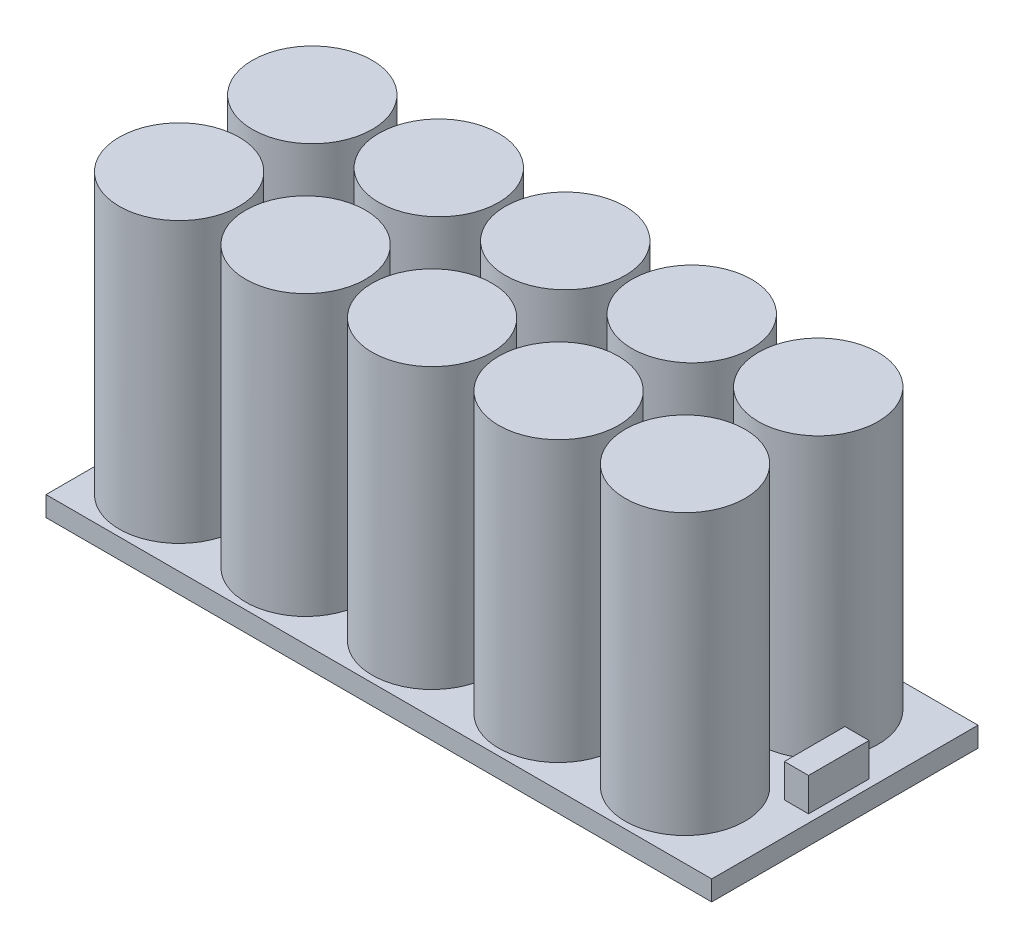
ISO-10303-21;
HEADER;
FILE_DESCRIPTION(('STEP AP214'),'2;1');
FILE_NAME('part.step','',(''),(''),'','','');
FILE_SCHEMA(('AUTOMOTIVE_DESIGN { 1 0 10303 214 1 1 1 1 }'));
ENDSEC;
DATA;
#1=APPLICATION_CONTEXT('core data for automotive mechanical design processes');
#2=APPLICATION_PROTOCOL_DEFINITION('international standard','automotive_design',2000,#1);
#3=PRODUCT_CONTEXT('',#1,'mechanical');
#4=PRODUCT('Part','Part','',(#3));
#5=PRODUCT_RELATED_PRODUCT_CATEGORY('part','',(#4));
#6=PRODUCT_DEFINITION_FORMATION('','',#4);
#7=PRODUCT_DEFINITION_CONTEXT('part definition',#1,'design');
#8=PRODUCT_DEFINITION('design','',#6,#7);
#9=PRODUCT_DEFINITION_SHAPE('','',#8);
#10=(LENGTH_UNIT() NAMED_UNIT(*) SI_UNIT(.MILLI.,.METRE.));
#11=(NAMED_UNIT(*) PLANE_ANGLE_UNIT() SI_UNIT($,.RADIAN.));
#12=(NAMED_UNIT(*) SI_UNIT($,.STERADIAN.) SOLID_ANGLE_UNIT());
#13=UNCERTAINTY_MEASURE_WITH_UNIT(LENGTH_MEASURE(1.E-05),#10,'distance_accuracy_value','');
#14=(GEOMETRIC_REPRESENTATION_CONTEXT(3) GLOBAL_UNCERTAINTY_ASSIGNED_CONTEXT((#13)) GLOBAL_UNIT_ASSIGNED_CONTEXT((#10,
#11,#12)) REPRESENTATION_CONTEXT('',''));
#15=CARTESIAN_POINT('',(0.,0.,0.));
#16=DIRECTION('',(0.,0.,1.));
#17=DIRECTION('',(1.,0.,0.));
#18=AXIS2_PLACEMENT_3D('',#15,#16,#17);
#19=CARTESIAN_POINT('',(0.,3.,0.));
#20=DIRECTION('',(0.,-1.,0.));
#21=DIRECTION('',(0.,0.,-1.));
#22=AXIS2_PLACEMENT_3D('',#19,#20,#21);
#23=PLANE('',#22);
#24=DIRECTION('',(0.,0.,-1.));
#25=VECTOR('',#24,1.);
#26=CARTESIAN_POINT('',(50.,3.,20.));
#27=LINE('',#26,#25);
#28=CARTESIAN_POINT('',(50.,3.,20.));
#29=VERTEX_POINT('',#28);
#30=CARTESIAN_POINT('',(50.,3.,-20.));
#31=VERTEX_POINT('',#30);
#32=EDGE_CURVE('E156',#29,#31,#27,.T.);
#33=ORIENTED_EDGE('',*,*,#32,.T.);
#34=DIRECTION('',(-1.,0.,0.));
#35=VECTOR('',#34,1.);
#36=CARTESIAN_POINT('',(-50.,3.,-20.));
#37=LINE('',#36,#35);
#38=CARTESIAN_POINT('',(-50.,3.,-20.));
#39=VERTEX_POINT('',#38);
#40=EDGE_CURVE('E159',#31,#39,#37,.T.);
#41=ORIENTED_EDGE('',*,*,#40,.T.);
#42=DIRECTION('',(0.,0.,1.));
#43=VECTOR('',#42,1.);
#44=CARTESIAN_POINT('',(-50.,3.,20.));
#45=LINE('',#44,#43);
#46=CARTESIAN_POINT('',(-50.,3.,20.));
#47=VERTEX_POINT('',#46);
#48=EDGE_CURVE('E162',#39,#47,#45,.T.);
#49=ORIENTED_EDGE('',*,*,#48,.T.);
#50=DIRECTION('',(1.,0.,0.));
#51=VECTOR('',#50,1.);
#52=CARTESIAN_POINT('',(-50.,3.,20.));
#53=LINE('',#52,#51);
#54=EDGE_CURVE('E164',#47,#29,#53,.T.);
#55=ORIENTED_EDGE('',*,*,#54,.T.);
#56=EDGE_LOOP('',(#33,#41,#49,#55));
#57=FACE_BOUND('',#56,.T.);
#58=CARTESIAN_POINT('',(-40.,3.,9.99999999999999));
#59=DIRECTION('',(0.,-1.,0.));
#60=DIRECTION('',(0.,0.,-1.));
#61=AXIS2_PLACEMENT_3D('',#58,#59,#60);
#62=CIRCLE('',#61,9.);
#63=CARTESIAN_POINT('',(-40.,3.,0.999999999999999));
#64=VERTEX_POINT('',#63);
#65=EDGE_CURVE('E185',#64,#64,#62,.F.);
#66=ORIENTED_EDGE('',*,*,#65,.F.);
#67=EDGE_LOOP('',(#66));
#68=FACE_BOUND('',#67,.T.);
#69=CARTESIAN_POINT('',(-21.,3.,9.99999999999999));
#70=DIRECTION('',(0.,-1.,0.));
#71=DIRECTION('',(0.,0.,-1.));
#72=AXIS2_PLACEMENT_3D('',#69,#70,#71);
#73=CIRCLE('',#72,9.);
#74=CARTESIAN_POINT('',(-21.,3.,0.999999999999999));
#75=VERTEX_POINT('',#74);
#76=EDGE_CURVE('E188',#75,#75,#73,.F.);
#77=ORIENTED_EDGE('',*,*,#76,.F.);
#78=EDGE_LOOP('',(#77));
#79=FACE_BOUND('',#78,.T.);
#80=CARTESIAN_POINT('',(-2.,3.,9.99999999999999));
#81=DIRECTION('',(0.,-1.,0.));
#82=DIRECTION('',(0.,0.,-1.));
#83=AXIS2_PLACEMENT_3D('',#80,#81,#82);
#84=CIRCLE('',#83,9.);
#85=CARTESIAN_POINT('',(-2.,3.,0.999999999999999));
#86=VERTEX_POINT('',#85);
#87=EDGE_CURVE('E191',#86,#86,#84,.F.);
#88=ORIENTED_EDGE('',*,*,#87,.F.);
#89=EDGE_LOOP('',(#88));
#90=FACE_BOUND('',#89,.T.);
#91=CARTESIAN_POINT('',(17.,3.,9.99999999999999));
#92=DIRECTION('',(0.,-1.,0.));
#93=DIRECTION('',(0.,0.,-1.));
#94=AXIS2_PLACEMENT_3D('',#91,#92,#93);
#95=CIRCLE('',#94,9.);
#96=CARTESIAN_POINT('',(17.,3.,0.999999999999999));
#97=VERTEX_POINT('',#96);
#98=EDGE_CURVE('E194',#97,#97,#95,.F.);
#99=ORIENTED_EDGE('',*,*,#98,.F.);
#100=EDGE_LOOP('',(#99));
#101=FACE_BOUND('',#100,.T.);
#102=CARTESIAN_POINT('',(36.,3.,9.99999999999999));
#103=DIRECTION('',(0.,-1.,0.));
#104=DIRECTION('',(0.,0.,-1.));
#105=AXIS2_PLACEMENT_3D('',#102,#103,#104);
#106=CIRCLE('',#105,9.);
#107=CARTESIAN_POINT('',(36.,3.,0.999999999999999));
#108=VERTEX_POINT('',#107);
#109=EDGE_CURVE('E197',#108,#108,#106,.F.);
#110=ORIENTED_EDGE('',*,*,#109,.F.);
#111=EDGE_LOOP('',(#110));
#112=FACE_BOUND('',#111,.T.);
#113=CARTESIAN_POINT('',(-21.0000000000001,3.,-10.));
#114=DIRECTION('',(0.,-1.,0.));
#115=DIRECTION('',(0.,0.,-1.));
#116=AXIS2_PLACEMENT_3D('',#113,#114,#115);
#117=CIRCLE('',#116,9.);
#118=CARTESIAN_POINT('',(-21.0000000000001,3.,-19.));
#119=VERTEX_POINT('',#118);
#120=EDGE_CURVE('E200',#119,#119,#117,.F.);
#121=ORIENTED_EDGE('',*,*,#120,.F.);
#122=EDGE_LOOP('',(#121));
#123=FACE_BOUND('',#122,.T.);
#124=CARTESIAN_POINT('',(-2.00000000000007,3.,-10.));
#125=DIRECTION('',(0.,-1.,0.));
#126=DIRECTION('',(0.,0.,-1.));
#127=AXIS2_PLACEMENT_3D('',#124,#125,#126);
#128=CIRCLE('',#127,9.);
#129=CARTESIAN_POINT('',(-2.00000000000007,3.,-19.));
#130=VERTEX_POINT('',#129);
#131=EDGE_CURVE('E203',#130,#130,#128,.F.);
#132=ORIENTED_EDGE('',*,*,#131,.F.);
#133=EDGE_LOOP('',(#132));
#134=FACE_BOUND('',#133,.T.);
#135=CARTESIAN_POINT('',(16.9999999999999,3.,-10.));
#136=DIRECTION('',(0.,-1.,0.));
#137=DIRECTION('',(0.,0.,-1.));
#138=AXIS2_PLACEMENT_3D('',#135,#136,#137);
#139=CIRCLE('',#138,9.);
#140=CARTESIAN_POINT('',(16.9999999999999,3.,-19.));
#141=VERTEX_POINT('',#140);
#142=EDGE_CURVE('E206',#141,#141,#139,.F.);
#143=ORIENTED_EDGE('',*,*,#142,.F.);
#144=EDGE_LOOP('',(#143));
#145=FACE_BOUND('',#144,.T.);
#146=CARTESIAN_POINT('',(35.9999999999999,3.,-10.));
#147=DIRECTION('',(0.,-1.,0.));
#148=DIRECTION('',(0.,0.,-1.));
#149=AXIS2_PLACEMENT_3D('',#146,#147,#148);
#150=CIRCLE('',#149,9.);
#151=CARTESIAN_POINT('',(35.9999999999999,3.,-19.));
#152=VERTEX_POINT('',#151);
#153=EDGE_CURVE('E42',#152,#152,#150,.F.);
#154=ORIENTED_EDGE('',*,*,#153,.F.);
#155=EDGE_LOOP('',(#154));
#156=FACE_BOUND('',#155,.T.);
#157=CARTESIAN_POINT('',(-40.0000000000001,3.,-10.));
#158=DIRECTION('',(0.,-1.,0.));
#159=DIRECTION('',(0.,0.,-1.));
#160=AXIS2_PLACEMENT_3D('',#157,#158,#159);
#161=CIRCLE('',#160,9.);
#162=CARTESIAN_POINT('',(-40.0000000000001,3.,-19.));
#163=VERTEX_POINT('',#162);
#164=EDGE_CURVE('E11',#163,#163,#161,.F.);
#165=ORIENTED_EDGE('',*,*,#164,.F.);
#166=EDGE_LOOP('',(#165));
#167=FACE_BOUND('',#166,.T.);
#168=DIRECTION('',(0.,0.,1.));
#169=VECTOR('',#168,1.);
#170=CARTESIAN_POINT('',(45.1816821701155,3.,-4.82622217345269));
#171=LINE('',#170,#169);
#172=CARTESIAN_POINT('',(45.1816821701155,3.,-4.82622217345269));
#173=VERTEX_POINT('',#172);
#174=CARTESIAN_POINT('',(45.1816821701155,3.,4.26543491181469));
#175=VERTEX_POINT('',#174);
#176=EDGE_CURVE('E119',#173,#175,#171,.T.);
#177=ORIENTED_EDGE('',*,*,#176,.F.);
#178=DIRECTION('',(-1.,0.,0.));
#179=VECTOR('',#178,1.);
#180=CARTESIAN_POINT('',(45.1816821701155,3.,-4.82622217345269));
#181=LINE('',#180,#179);
#182=CARTESIAN_POINT('',(48.8112972080323,3.,-4.82622217345269));
#183=VERTEX_POINT('',#182);
#184=EDGE_CURVE('E116',#183,#173,#181,.T.);
#185=ORIENTED_EDGE('',*,*,#184,.F.);
#186=DIRECTION('',(0.,0.,-1.));
#187=VECTOR('',#186,1.);
#188=CARTESIAN_POINT('',(48.8112972080323,3.,-4.82622217345269));
#189=LINE('',#188,#187);
#190=CARTESIAN_POINT('',(48.8112972080323,3.,4.26543491181469));
#191=VERTEX_POINT('',#190);
#192=EDGE_CURVE('E54',#191,#183,#189,.T.);
#193=ORIENTED_EDGE('',*,*,#192,.F.);
#194=DIRECTION('',(1.,0.,0.));
#195=VECTOR('',#194,1.);
#196=CARTESIAN_POINT('',(45.1816821701155,3.,4.26543491181469));
#197=LINE('',#196,#195);
#198=EDGE_CURVE('E49',#175,#191,#197,.T.);
#199=ORIENTED_EDGE('',*,*,#198,.F.);
#200=EDGE_LOOP('',(#177,#185,#193,#199));
#201=FACE_BOUND('',#200,.T.);
#202=ADVANCED_FACE('F34',(#57,#68,#79,#90,#101,#112,#123,#134,#145,#156,#167,#201),#23,.F.);
#203=CARTESIAN_POINT('',(50.,3.,20.));
#204=DIRECTION('',(-1.,0.,0.));
#205=DIRECTION('',(0.,0.,1.));
#206=AXIS2_PLACEMENT_3D('',#203,#204,#205);
#207=PLANE('',#206);
#208=DIRECTION('',(0.,0.,-1.));
#209=VECTOR('',#208,1.);
#210=CARTESIAN_POINT('',(50.,0.,20.));
#211=LINE('',#210,#209);
#212=CARTESIAN_POINT('',(50.,0.,20.));
#213=VERTEX_POINT('',#212);
#214=CARTESIAN_POINT('',(50.,0.,-20.));
#215=VERTEX_POINT('',#214);
#216=EDGE_CURVE('E155',#213,#215,#211,.T.);
#217=ORIENTED_EDGE('',*,*,#216,.T.);
#218=DIRECTION('',(0.,-1.,0.));
#219=VECTOR('',#218,1.);
#220=CARTESIAN_POINT('',(50.,3.,-20.));
#221=LINE('',#220,#219);
#222=EDGE_CURVE('E182',#31,#215,#221,.T.);
#223=ORIENTED_EDGE('',*,*,#222,.F.);
#224=ORIENTED_EDGE('',*,*,#32,.F.);
#225=DIRECTION('',(0.,-1.,0.));
#226=VECTOR('',#225,1.);
#227=CARTESIAN_POINT('',(50.,3.,20.));
#228=LINE('',#227,#226);
#229=EDGE_CURVE('E166',#29,#213,#228,.T.);
#230=ORIENTED_EDGE('',*,*,#229,.T.);
#231=EDGE_LOOP('',(#217,#223,#224,#230));
#232=FACE_BOUND('',#231,.T.);
#233=ADVANCED_FACE('F36',(#232),#207,.F.);
#234=CARTESIAN_POINT('',(-50.,3.,-20.));
#235=DIRECTION('',(0.,0.,1.));
#236=DIRECTION('',(1.,0.,0.));
#237=AXIS2_PLACEMENT_3D('',#234,#235,#236);
#238=PLANE('',#237);
#239=DIRECTION('',(-1.,0.,0.));
#240=VECTOR('',#239,1.);
#241=CARTESIAN_POINT('',(-50.,0.,-20.));
#242=LINE('',#241,#240);
#243=CARTESIAN_POINT('',(-50.,0.,-20.));
#244=VERTEX_POINT('',#243);
#245=EDGE_CURVE('E169',#215,#244,#242,.T.);
#246=ORIENTED_EDGE('',*,*,#245,.T.);
#247=DIRECTION('',(0.,-1.,0.));
#248=VECTOR('',#247,1.);
#249=CARTESIAN_POINT('',(-50.,3.,-20.));
#250=LINE('',#249,#248);
#251=EDGE_CURVE('E179',#39,#244,#250,.T.);
#252=ORIENTED_EDGE('',*,*,#251,.F.);
#253=ORIENTED_EDGE('',*,*,#40,.F.);
#254=ORIENTED_EDGE('',*,*,#222,.T.);
#255=EDGE_LOOP('',(#246,#252,#253,#254));
#256=FACE_BOUND('',#255,.T.);
#257=ADVANCED_FACE('F334',(#256),#238,.F.);
#258=CARTESIAN_POINT('',(-50.,3.,20.));
#259=DIRECTION('',(1.,0.,0.));
#260=DIRECTION('',(0.,0.,-1.));
#261=AXIS2_PLACEMENT_3D('',#258,#259,#260);
#262=PLANE('',#261);
#263=DIRECTION('',(0.,0.,1.));
#264=VECTOR('',#263,1.);
#265=CARTESIAN_POINT('',(-50.,0.,20.));
#266=LINE('',#265,#264);
#267=CARTESIAN_POINT('',(-50.,0.,20.));
#268=VERTEX_POINT('',#267);
#269=EDGE_CURVE('E171',#244,#268,#266,.T.);
#270=ORIENTED_EDGE('',*,*,#269,.T.);
#271=DIRECTION('',(0.,-1.,0.));
#272=VECTOR('',#271,1.);
#273=CARTESIAN_POINT('',(-50.,3.,20.));
#274=LINE('',#273,#272);
#275=EDGE_CURVE('E176',#47,#268,#274,.T.);
#276=ORIENTED_EDGE('',*,*,#275,.F.);
#277=ORIENTED_EDGE('',*,*,#48,.F.);
#278=ORIENTED_EDGE('',*,*,#251,.T.);
#279=EDGE_LOOP('',(#270,#276,#277,#278));
#280=FACE_BOUND('',#279,.T.);
#281=ADVANCED_FACE('F331',(#280),#262,.F.);
#282=CARTESIAN_POINT('',(-50.,3.,20.));
#283=DIRECTION('',(0.,0.,-1.));
#284=DIRECTION('',(-1.,0.,0.));
#285=AXIS2_PLACEMENT_3D('',#282,#283,#284);
#286=PLANE('',#285);
#287=DIRECTION('',(1.,0.,0.));
#288=VECTOR('',#287,1.);
#289=CARTESIAN_POINT('',(-50.,0.,20.));
#290=LINE('',#289,#288);
#291=EDGE_CURVE('E160',#268,#213,#290,.T.);
#292=ORIENTED_EDGE('',*,*,#291,.T.);
#293=ORIENTED_EDGE('',*,*,#229,.F.);
#294=ORIENTED_EDGE('',*,*,#54,.F.);
#295=ORIENTED_EDGE('',*,*,#275,.T.);
#296=EDGE_LOOP('',(#292,#293,#294,#295));
#297=FACE_BOUND('',#296,.T.);
#298=ADVANCED_FACE('F327',(#297),#286,.F.);
#299=CARTESIAN_POINT('',(0.,0.,0.));
#300=DIRECTION('',(0.,-1.,0.));
#301=DIRECTION('',(0.,0.,-1.));
#302=AXIS2_PLACEMENT_3D('',#299,#300,#301);
#303=PLANE('',#302);
#304=ORIENTED_EDGE('',*,*,#216,.F.);
#305=ORIENTED_EDGE('',*,*,#291,.F.);
#306=ORIENTED_EDGE('',*,*,#269,.F.);
#307=ORIENTED_EDGE('',*,*,#245,.F.);
#308=EDGE_LOOP('',(#304,#305,#306,#307));
#309=FACE_BOUND('',#308,.T.);
#310=ADVANCED_FACE('F322',(#309),#303,.T.);
#311=CARTESIAN_POINT('',(-40.,45.,9.99999999999999));
#312=DIRECTION('',(0.,-1.,0.));
#313=DIRECTION('',(0.,0.,-1.));
#314=AXIS2_PLACEMENT_3D('',#311,#312,#313);
#315=CYLINDRICAL_SURFACE('',#314,9.);
#316=CARTESIAN_POINT('',(-40.,45.,9.99999999999999));
#317=DIRECTION('',(0.,1.,0.));
#318=DIRECTION('',(0.,0.,1.));
#319=AXIS2_PLACEMENT_3D('',#316,#317,#318);
#320=CIRCLE('',#319,9.);
#321=CARTESIAN_POINT('',(-40.,45.,19.));
#322=VERTEX_POINT('',#321);
#323=EDGE_CURVE('E152',#322,#322,#320,.T.);
#324=ORIENTED_EDGE('',*,*,#323,.F.);
#325=EDGE_LOOP('',(#324));
#326=FACE_BOUND('',#325,.T.);
#327=ORIENTED_EDGE('',*,*,#65,.T.);
#328=EDGE_LOOP('',(#327));
#329=FACE_BOUND('',#328,.T.);
#330=ADVANCED_FACE('F319',(#326,#329),#315,.T.);
#331=CARTESIAN_POINT('',(-40.,45.,9.99999999999999));
#332=DIRECTION('',(0.,1.,0.));
#333=DIRECTION('',(0.,0.,1.));
#334=AXIS2_PLACEMENT_3D('',#331,#332,#333);
#335=PLANE('',#334);
#336=ORIENTED_EDGE('',*,*,#323,.T.);
#337=EDGE_LOOP('',(#336));
#338=FACE_BOUND('',#337,.T.);
#339=ADVANCED_FACE('F315',(#338),#335,.T.);
#340=CARTESIAN_POINT('',(-21.,45.,9.99999999999999));
#341=DIRECTION('',(0.,-1.,0.));
#342=DIRECTION('',(0.,0.,-1.));
#343=AXIS2_PLACEMENT_3D('',#340,#341,#342);
#344=CYLINDRICAL_SURFACE('',#343,9.);
#345=CARTESIAN_POINT('',(-21.,45.,9.99999999999999));
#346=DIRECTION('',(0.,1.,0.));
#347=DIRECTION('',(0.,0.,1.));
#348=AXIS2_PLACEMENT_3D('',#345,#346,#347);
#349=CIRCLE('',#348,9.);
#350=CARTESIAN_POINT('',(-21.,45.,19.));
#351=VERTEX_POINT('',#350);
#352=EDGE_CURVE('E149',#351,#351,#349,.T.);
#353=ORIENTED_EDGE('',*,*,#352,.F.);
#354=EDGE_LOOP('',(#353));
#355=FACE_BOUND('',#354,.T.);
#356=ORIENTED_EDGE('',*,*,#76,.T.);
#357=EDGE_LOOP('',(#356));
#358=FACE_BOUND('',#357,.T.);
#359=ADVANCED_FACE('F311',(#355,#358),#344,.T.);
#360=CARTESIAN_POINT('',(-21.,45.,9.99999999999999));
#361=DIRECTION('',(0.,1.,0.));
#362=DIRECTION('',(0.,0.,1.));
#363=AXIS2_PLACEMENT_3D('',#360,#361,#362);
#364=PLANE('',#363);
#365=ORIENTED_EDGE('',*,*,#352,.T.);
#366=EDGE_LOOP('',(#365));
#367=FACE_BOUND('',#366,.T.);
#368=ADVANCED_FACE('F307',(#367),#364,.T.);
#369=CARTESIAN_POINT('',(-2.,45.,9.99999999999999));
#370=DIRECTION('',(0.,-1.,0.));
#371=DIRECTION('',(0.,0.,-1.));
#372=AXIS2_PLACEMENT_3D('',#369,#370,#371);
#373=CYLINDRICAL_SURFACE('',#372,9.);
#374=CARTESIAN_POINT('',(-2.,45.,9.99999999999999));
#375=DIRECTION('',(0.,1.,0.));
#376=DIRECTION('',(0.,0.,1.));
#377=AXIS2_PLACEMENT_3D('',#374,#375,#376);
#378=CIRCLE('',#377,9.);
#379=CARTESIAN_POINT('',(-2.,45.,19.));
#380=VERTEX_POINT('',#379);
#381=EDGE_CURVE('E146',#380,#380,#378,.T.);
#382=ORIENTED_EDGE('',*,*,#381,.F.);
#383=EDGE_LOOP('',(#382));
#384=FACE_BOUND('',#383,.T.);
#385=ORIENTED_EDGE('',*,*,#87,.T.);
#386=EDGE_LOOP('',(#385));
#387=FACE_BOUND('',#386,.T.);
#388=ADVANCED_FACE('F303',(#384,#387),#373,.T.);
#389=CARTESIAN_POINT('',(-2.,45.,9.99999999999999));
#390=DIRECTION('',(0.,1.,0.));
#391=DIRECTION('',(0.,0.,1.));
#392=AXIS2_PLACEMENT_3D('',#389,#390,#391);
#393=PLANE('',#392);
#394=ORIENTED_EDGE('',*,*,#381,.T.);
#395=EDGE_LOOP('',(#394));
#396=FACE_BOUND('',#395,.T.);
#397=ADVANCED_FACE('F299',(#396),#393,.T.);
#398=CARTESIAN_POINT('',(17.,45.,9.99999999999999));
#399=DIRECTION('',(0.,-1.,0.));
#400=DIRECTION('',(0.,0.,-1.));
#401=AXIS2_PLACEMENT_3D('',#398,#399,#400);
#402=CYLINDRICAL_SURFACE('',#401,9.);
#403=CARTESIAN_POINT('',(17.,45.,9.99999999999999));
#404=DIRECTION('',(0.,1.,0.));
#405=DIRECTION('',(0.,0.,1.));
#406=AXIS2_PLACEMENT_3D('',#403,#404,#405);
#407=CIRCLE('',#406,9.);
#408=CARTESIAN_POINT('',(17.,45.,19.));
#409=VERTEX_POINT('',#408);
#410=EDGE_CURVE('E143',#409,#409,#407,.T.);
#411=ORIENTED_EDGE('',*,*,#410,.F.);
#412=EDGE_LOOP('',(#411));
#413=FACE_BOUND('',#412,.T.);
#414=ORIENTED_EDGE('',*,*,#98,.T.);
#415=EDGE_LOOP('',(#414));
#416=FACE_BOUND('',#415,.T.);
#417=ADVANCED_FACE('F295',(#413,#416),#402,.T.);
#418=CARTESIAN_POINT('',(17.,45.,9.99999999999999));
#419=DIRECTION('',(0.,1.,0.));
#420=DIRECTION('',(0.,0.,1.));
#421=AXIS2_PLACEMENT_3D('',#418,#419,#420);
#422=PLANE('',#421);
#423=ORIENTED_EDGE('',*,*,#410,.T.);
#424=EDGE_LOOP('',(#423));
#425=FACE_BOUND('',#424,.T.);
#426=ADVANCED_FACE('F291',(#425),#422,.T.);
#427=CARTESIAN_POINT('',(36.,45.,9.99999999999999));
#428=DIRECTION('',(0.,-1.,0.));
#429=DIRECTION('',(0.,0.,-1.));
#430=AXIS2_PLACEMENT_3D('',#427,#428,#429);
#431=CYLINDRICAL_SURFACE('',#430,9.);
#432=CARTESIAN_POINT('',(36.,45.,9.99999999999999));
#433=DIRECTION('',(0.,1.,0.));
#434=DIRECTION('',(0.,0.,1.));
#435=AXIS2_PLACEMENT_3D('',#432,#433,#434);
#436=CIRCLE('',#435,9.);
#437=CARTESIAN_POINT('',(36.,45.,19.));
#438=VERTEX_POINT('',#437);
#439=EDGE_CURVE('E140',#438,#438,#436,.T.);
#440=ORIENTED_EDGE('',*,*,#439,.F.);
#441=EDGE_LOOP('',(#440));
#442=FACE_BOUND('',#441,.T.);
#443=ORIENTED_EDGE('',*,*,#109,.T.);
#444=EDGE_LOOP('',(#443));
#445=FACE_BOUND('',#444,.T.);
#446=ADVANCED_FACE('F287',(#442,#445),#431,.T.);
#447=CARTESIAN_POINT('',(36.,45.,9.99999999999999));
#448=DIRECTION('',(0.,1.,0.));
#449=DIRECTION('',(0.,0.,1.));
#450=AXIS2_PLACEMENT_3D('',#447,#448,#449);
#451=PLANE('',#450);
#452=ORIENTED_EDGE('',*,*,#439,.T.);
#453=EDGE_LOOP('',(#452));
#454=FACE_BOUND('',#453,.T.);
#455=ADVANCED_FACE('F283',(#454),#451,.T.);
#456=CARTESIAN_POINT('',(-21.0000000000001,45.,-10.));
#457=DIRECTION('',(0.,-1.,0.));
#458=DIRECTION('',(0.,0.,-1.));
#459=AXIS2_PLACEMENT_3D('',#456,#457,#458);
#460=CYLINDRICAL_SURFACE('',#459,9.);
#461=CARTESIAN_POINT('',(-21.0000000000001,45.,-10.));
#462=DIRECTION('',(0.,1.,0.));
#463=DIRECTION('',(0.,0.,1.));
#464=AXIS2_PLACEMENT_3D('',#461,#462,#463);
#465=CIRCLE('',#464,9.);
#466=CARTESIAN_POINT('',(-21.0000000000001,45.,-1.00000000000001));
#467=VERTEX_POINT('',#466);
#468=EDGE_CURVE('E137',#467,#467,#465,.T.);
#469=ORIENTED_EDGE('',*,*,#468,.F.);
#470=EDGE_LOOP('',(#469));
#471=FACE_BOUND('',#470,.T.);
#472=ORIENTED_EDGE('',*,*,#120,.T.);
#473=EDGE_LOOP('',(#472));
#474=FACE_BOUND('',#473,.T.);
#475=ADVANCED_FACE('F279',(#471,#474),#460,.T.);
#476=CARTESIAN_POINT('',(-21.0000000000001,45.,-10.));
#477=DIRECTION('',(0.,1.,0.));
#478=DIRECTION('',(0.,0.,1.));
#479=AXIS2_PLACEMENT_3D('',#476,#477,#478);
#480=PLANE('',#479);
#481=ORIENTED_EDGE('',*,*,#468,.T.);
#482=EDGE_LOOP('',(#481));
#483=FACE_BOUND('',#482,.T.);
#484=ADVANCED_FACE('F275',(#483),#480,.T.);
#485=CARTESIAN_POINT('',(-2.00000000000007,45.,-10.));
#486=DIRECTION('',(0.,-1.,0.));
#487=DIRECTION('',(0.,0.,-1.));
#488=AXIS2_PLACEMENT_3D('',#485,#486,#487);
#489=CYLINDRICAL_SURFACE('',#488,9.);
#490=CARTESIAN_POINT('',(-2.00000000000007,45.,-10.));
#491=DIRECTION('',(0.,1.,0.));
#492=DIRECTION('',(0.,0.,1.));
#493=AXIS2_PLACEMENT_3D('',#490,#491,#492);
#494=CIRCLE('',#493,9.);
#495=CARTESIAN_POINT('',(-2.00000000000007,45.,-1.00000000000001));
#496=VERTEX_POINT('',#495);
#497=EDGE_CURVE('E134',#496,#496,#494,.T.);
#498=ORIENTED_EDGE('',*,*,#497,.F.);
#499=EDGE_LOOP('',(#498));
#500=FACE_BOUND('',#499,.T.);
#501=ORIENTED_EDGE('',*,*,#131,.T.);
#502=EDGE_LOOP('',(#501));
#503=FACE_BOUND('',#502,.T.);
#504=ADVANCED_FACE('F271',(#500,#503),#489,.T.);
#505=CARTESIAN_POINT('',(-2.00000000000007,45.,-10.));
#506=DIRECTION('',(0.,1.,0.));
#507=DIRECTION('',(0.,0.,1.));
#508=AXIS2_PLACEMENT_3D('',#505,#506,#507);
#509=PLANE('',#508);
#510=ORIENTED_EDGE('',*,*,#497,.T.);
#511=EDGE_LOOP('',(#510));
#512=FACE_BOUND('',#511,.T.);
#513=ADVANCED_FACE('F267',(#512),#509,.T.);
#514=CARTESIAN_POINT('',(16.9999999999999,45.,-10.));
#515=DIRECTION('',(0.,-1.,0.));
#516=DIRECTION('',(0.,0.,-1.));
#517=AXIS2_PLACEMENT_3D('',#514,#515,#516);
#518=CYLINDRICAL_SURFACE('',#517,9.);
#519=CARTESIAN_POINT('',(16.9999999999999,45.,-10.));
#520=DIRECTION('',(0.,1.,0.));
#521=DIRECTION('',(0.,0.,1.));
#522=AXIS2_PLACEMENT_3D('',#519,#520,#521);
#523=CIRCLE('',#522,9.);
#524=CARTESIAN_POINT('',(16.9999999999999,45.,-1.00000000000001));
#525=VERTEX_POINT('',#524);
#526=EDGE_CURVE('E131',#525,#525,#523,.T.);
#527=ORIENTED_EDGE('',*,*,#526,.F.);
#528=EDGE_LOOP('',(#527));
#529=FACE_BOUND('',#528,.T.);
#530=ORIENTED_EDGE('',*,*,#142,.T.);
#531=EDGE_LOOP('',(#530));
#532=FACE_BOUND('',#531,.T.);
#533=ADVANCED_FACE('F263',(#529,#532),#518,.T.);
#534=CARTESIAN_POINT('',(16.9999999999999,45.,-10.));
#535=DIRECTION('',(0.,1.,0.));
#536=DIRECTION('',(0.,0.,1.));
#537=AXIS2_PLACEMENT_3D('',#534,#535,#536);
#538=PLANE('',#537);
#539=ORIENTED_EDGE('',*,*,#526,.T.);
#540=EDGE_LOOP('',(#539));
#541=FACE_BOUND('',#540,.T.);
#542=ADVANCED_FACE('F259',(#541),#538,.T.);
#543=CARTESIAN_POINT('',(35.9999999999999,45.,-10.));
#544=DIRECTION('',(0.,-1.,0.));
#545=DIRECTION('',(0.,0.,-1.));
#546=AXIS2_PLACEMENT_3D('',#543,#544,#545);
#547=CYLINDRICAL_SURFACE('',#546,9.);
#548=CARTESIAN_POINT('',(35.9999999999999,45.,-10.));
#549=DIRECTION('',(0.,1.,0.));
#550=DIRECTION('',(0.,0.,1.));
#551=AXIS2_PLACEMENT_3D('',#548,#549,#550);
#552=CIRCLE('',#551,9.);
#553=CARTESIAN_POINT('',(35.9999999999999,45.,-1.00000000000001));
#554=VERTEX_POINT('',#553);
#555=EDGE_CURVE('E123',#554,#554,#552,.T.);
#556=ORIENTED_EDGE('',*,*,#555,.F.);
#557=EDGE_LOOP('',(#556));
#558=FACE_BOUND('',#557,.T.);
#559=ORIENTED_EDGE('',*,*,#153,.T.);
#560=EDGE_LOOP('',(#559));
#561=FACE_BOUND('',#560,.T.);
#562=ADVANCED_FACE('F211',(#558,#561),#547,.T.);
#563=CARTESIAN_POINT('',(35.9999999999999,45.,-10.));
#564=DIRECTION('',(0.,1.,0.));
#565=DIRECTION('',(0.,0.,1.));
#566=AXIS2_PLACEMENT_3D('',#563,#564,#565);
#567=PLANE('',#566);
#568=ORIENTED_EDGE('',*,*,#555,.T.);
#569=EDGE_LOOP('',(#568));
#570=FACE_BOUND('',#569,.T.);
#571=ADVANCED_FACE('F252',(#570),#567,.T.);
#572=CARTESIAN_POINT('',(-40.0000000000001,45.,-10.));
#573=DIRECTION('',(0.,-1.,0.));
#574=DIRECTION('',(0.,0.,-1.));
#575=AXIS2_PLACEMENT_3D('',#572,#573,#574);
#576=CYLINDRICAL_SURFACE('',#575,9.);
#577=CARTESIAN_POINT('',(-40.0000000000001,45.,-10.));
#578=DIRECTION('',(0.,1.,0.));
#579=DIRECTION('',(0.,0.,1.));
#580=AXIS2_PLACEMENT_3D('',#577,#578,#579);
#581=CIRCLE('',#580,9.);
#582=CARTESIAN_POINT('',(-40.0000000000001,45.,-1.00000000000001));
#583=VERTEX_POINT('',#582);
#584=EDGE_CURVE('E120',#583,#583,#581,.T.);
#585=ORIENTED_EDGE('',*,*,#584,.F.);
#586=EDGE_LOOP('',(#585));
#587=FACE_BOUND('',#586,.T.);
#588=ORIENTED_EDGE('',*,*,#164,.T.);
#589=EDGE_LOOP('',(#588));
#590=FACE_BOUND('',#589,.T.);
#591=ADVANCED_FACE('F248',(#587,#590),#576,.T.);
#592=CARTESIAN_POINT('',(-40.0000000000001,45.,-10.));
#593=DIRECTION('',(0.,1.,0.));
#594=DIRECTION('',(0.,0.,1.));
#595=AXIS2_PLACEMENT_3D('',#592,#593,#594);
#596=PLANE('',#595);
#597=ORIENTED_EDGE('',*,*,#584,.T.);
#598=EDGE_LOOP('',(#597));
#599=FACE_BOUND('',#598,.T.);
#600=ADVANCED_FACE('F245',(#599),#596,.T.);
#601=CARTESIAN_POINT('',(45.1816821701155,8.,-4.82622217345269));
#602=DIRECTION('',(1.,0.,0.));
#603=DIRECTION('',(0.,0.,-1.));
#604=AXIS2_PLACEMENT_3D('',#601,#602,#603);
#605=PLANE('',#604);
#606=ORIENTED_EDGE('',*,*,#176,.T.);
#607=DIRECTION('',(0.,-1.,0.));
#608=VECTOR('',#607,1.);
#609=CARTESIAN_POINT('',(45.1816821701155,8.,4.26543491181469));
#610=LINE('',#609,#608);
#611=CARTESIAN_POINT('',(45.1816821701155,8.,4.26543491181469));
#612=VERTEX_POINT('',#611);
#613=EDGE_CURVE('E100',#612,#175,#610,.T.);
#614=ORIENTED_EDGE('',*,*,#613,.F.);
#615=DIRECTION('',(0.,0.,1.));
#616=VECTOR('',#615,1.);
#617=CARTESIAN_POINT('',(45.1816821701155,8.,-4.82622217345269));
#618=LINE('',#617,#616);
#619=CARTESIAN_POINT('',(45.1816821701155,8.,-4.82622217345269));
#620=VERTEX_POINT('',#619);
#621=EDGE_CURVE('E107',#620,#612,#618,.T.);
#622=ORIENTED_EDGE('',*,*,#621,.F.);
#623=DIRECTION('',(0.,-1.,0.));
#624=VECTOR('',#623,1.);
#625=CARTESIAN_POINT('',(45.1816821701155,8.,-4.82622217345269));
#626=LINE('',#625,#624);
#627=EDGE_CURVE('E223',#620,#173,#626,.T.);
#628=ORIENTED_EDGE('',*,*,#627,.T.);
#629=EDGE_LOOP('',(#606,#614,#622,#628));
#630=FACE_BOUND('',#629,.T.);
#631=ADVANCED_FACE('F118',(#630),#605,.F.);
#632=CARTESIAN_POINT('',(45.1816821701155,8.,4.26543491181469));
#633=DIRECTION('',(0.,0.,-1.));
#634=DIRECTION('',(-1.,0.,0.));
#635=AXIS2_PLACEMENT_3D('',#632,#633,#634);
#636=PLANE('',#635);
#637=ORIENTED_EDGE('',*,*,#198,.T.);
#638=DIRECTION('',(0.,-1.,0.));
#639=VECTOR('',#638,1.);
#640=CARTESIAN_POINT('',(48.8112972080323,8.,4.26543491181469));
#641=LINE('',#640,#639);
#642=CARTESIAN_POINT('',(48.8112972080323,8.,4.26543491181469));
#643=VERTEX_POINT('',#642);
#644=EDGE_CURVE('E103',#643,#191,#641,.T.);
#645=ORIENTED_EDGE('',*,*,#644,.F.);
#646=DIRECTION('',(1.,0.,0.));
#647=VECTOR('',#646,1.);
#648=CARTESIAN_POINT('',(45.1816821701155,8.,4.26543491181469));
#649=LINE('',#648,#647);
#650=EDGE_CURVE('E96',#612,#643,#649,.T.);
#651=ORIENTED_EDGE('',*,*,#650,.F.);
#652=ORIENTED_EDGE('',*,*,#613,.T.);
#653=EDGE_LOOP('',(#637,#645,#651,#652));
#654=FACE_BOUND('',#653,.T.);
#655=ADVANCED_FACE('F98',(#654),#636,.F.);
#656=CARTESIAN_POINT('',(48.8112972080323,8.,-4.82622217345269));
#657=DIRECTION('',(-1.,0.,0.));
#658=DIRECTION('',(0.,0.,1.));
#659=AXIS2_PLACEMENT_3D('',#656,#657,#658);
#660=PLANE('',#659);
#661=ORIENTED_EDGE('',*,*,#192,.T.);
#662=DIRECTION('',(0.,-1.,0.));
#663=VECTOR('',#662,1.);
#664=CARTESIAN_POINT('',(48.8112972080323,8.,-4.82622217345269));
#665=LINE('',#664,#663);
#666=CARTESIAN_POINT('',(48.8112972080323,8.,-4.82622217345269));
#667=VERTEX_POINT('',#666);
#668=EDGE_CURVE('E125',#667,#183,#665,.T.);
#669=ORIENTED_EDGE('',*,*,#668,.F.);
#670=DIRECTION('',(0.,0.,-1.));
#671=VECTOR('',#670,1.);
#672=CARTESIAN_POINT('',(48.8112972080323,8.,-4.82622217345269));
#673=LINE('',#672,#671);
#674=EDGE_CURVE('E106',#643,#667,#673,.T.);
#675=ORIENTED_EDGE('',*,*,#674,.F.);
#676=ORIENTED_EDGE('',*,*,#644,.T.);
#677=EDGE_LOOP('',(#661,#669,#675,#676));
#678=FACE_BOUND('',#677,.T.);
#679=ADVANCED_FACE('F232',(#678),#660,.F.);
#680=CARTESIAN_POINT('',(45.1816821701155,8.,-4.82622217345269));
#681=DIRECTION('',(0.,0.,1.));
#682=DIRECTION('',(1.,0.,0.));
#683=AXIS2_PLACEMENT_3D('',#680,#681,#682);
#684=PLANE('',#683);
#685=ORIENTED_EDGE('',*,*,#184,.T.);
#686=ORIENTED_EDGE('',*,*,#627,.F.);
#687=DIRECTION('',(-1.,0.,0.));
#688=VECTOR('',#687,1.);
#689=CARTESIAN_POINT('',(45.1816821701155,8.,-4.82622217345269));
#690=LINE('',#689,#688);
#691=EDGE_CURVE('E112',#667,#620,#690,.T.);
#692=ORIENTED_EDGE('',*,*,#691,.F.);
#693=ORIENTED_EDGE('',*,*,#668,.T.);
#694=EDGE_LOOP('',(#685,#686,#692,#693));
#695=FACE_BOUND('',#694,.T.);
#696=ADVANCED_FACE('F222',(#695),#684,.F.);
#697=CARTESIAN_POINT('',(0.,8.,0.));
#698=DIRECTION('',(0.,1.,0.));
#699=DIRECTION('',(0.,0.,1.));
#700=AXIS2_PLACEMENT_3D('',#697,#698,#699);
#701=PLANE('',#700);
#702=ORIENTED_EDGE('',*,*,#621,.T.);
#703=ORIENTED_EDGE('',*,*,#650,.T.);
#704=ORIENTED_EDGE('',*,*,#674,.T.);
#705=ORIENTED_EDGE('',*,*,#691,.T.);
#706=EDGE_LOOP('',(#702,#703,#704,#705));
#707=FACE_BOUND('',#706,.T.);
#708=ADVANCED_FACE('F110',(#707),#701,.T.);
#709=CLOSED_SHELL('',(#202,#233,#257,#281,#298,#310,#330,#339,#359,#368,#388,#397,#417,#426,
#446,#455,#475,#484,#504,#513,#533,#542,#562,#571,#591,#600,#631,#655,#679,#696,#708));
#710=MANIFOLD_SOLID_BREP('B2',#709);
#711=ADVANCED_BREP_SHAPE_REPRESENTATION('',(#18,#710),#14);
#712=SHAPE_DEFINITION_REPRESENTATION(#9,#711);
ENDSEC;
END-ISO-10303-21;
